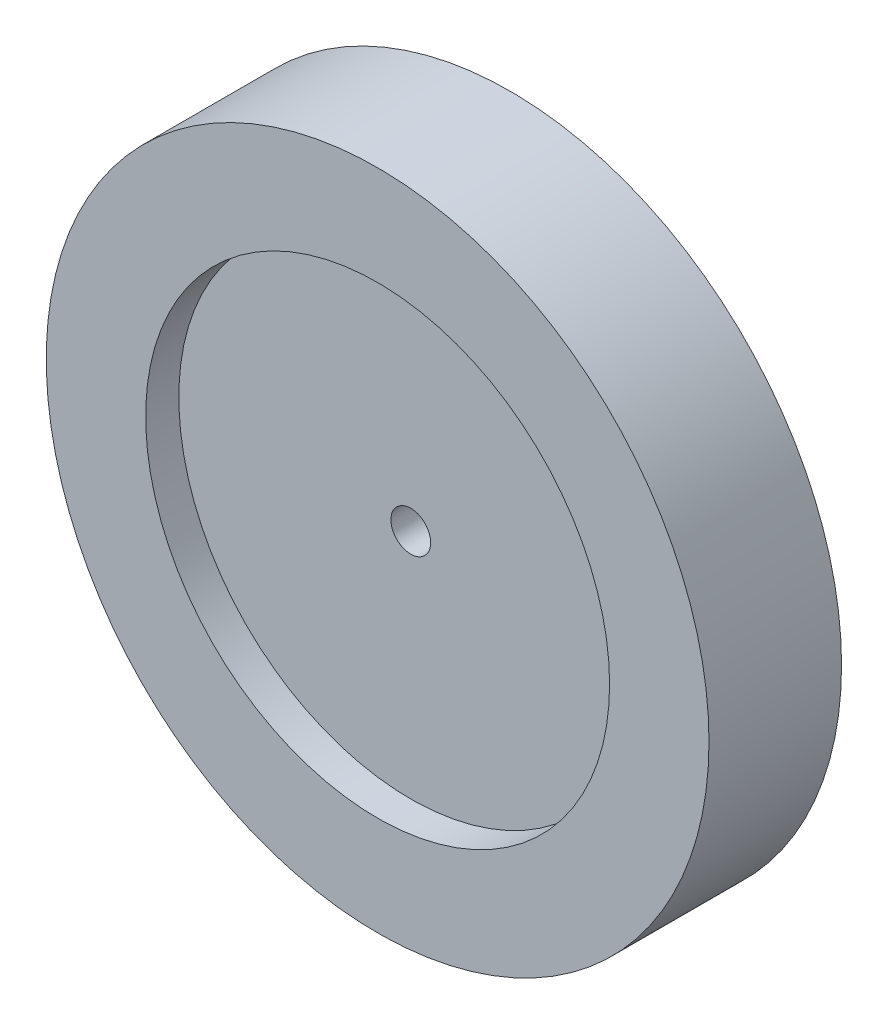
ISO-10303-21;
HEADER;
FILE_DESCRIPTION(('STEP AP214'),'2;1');
FILE_NAME('part.step','',(''),(''),'','','');
FILE_SCHEMA(('AUTOMOTIVE_DESIGN { 1 0 10303 214 1 1 1 1 }'));
ENDSEC;
DATA;
#1=APPLICATION_CONTEXT('core data for automotive mechanical design processes');
#2=APPLICATION_PROTOCOL_DEFINITION('international standard','automotive_design',2000,#1);
#3=PRODUCT_CONTEXT('',#1,'mechanical');
#4=PRODUCT('Part','Part','',(#3));
#5=PRODUCT_RELATED_PRODUCT_CATEGORY('part','',(#4));
#6=PRODUCT_DEFINITION_FORMATION('','',#4);
#7=PRODUCT_DEFINITION_CONTEXT('part definition',#1,'design');
#8=PRODUCT_DEFINITION('design','',#6,#7);
#9=PRODUCT_DEFINITION_SHAPE('','',#8);
#10=(LENGTH_UNIT() NAMED_UNIT(*) SI_UNIT(.MILLI.,.METRE.));
#11=(NAMED_UNIT(*) PLANE_ANGLE_UNIT() SI_UNIT($,.RADIAN.));
#12=(NAMED_UNIT(*) SI_UNIT($,.STERADIAN.) SOLID_ANGLE_UNIT());
#13=UNCERTAINTY_MEASURE_WITH_UNIT(LENGTH_MEASURE(1.E-05),#10,'distance_accuracy_value','');
#14=(GEOMETRIC_REPRESENTATION_CONTEXT(3) GLOBAL_UNCERTAINTY_ASSIGNED_CONTEXT((#13)) GLOBAL_UNIT_ASSIGNED_CONTEXT((#10,
#11,#12)) REPRESENTATION_CONTEXT('',''));
#15=CARTESIAN_POINT('',(0.,0.,0.));
#16=DIRECTION('',(0.,0.,1.));
#17=DIRECTION('',(1.,0.,0.));
#18=AXIS2_PLACEMENT_3D('',#15,#16,#17);
#19=CARTESIAN_POINT('',(0.,0.,10.));
#20=DIRECTION('',(0.,0.,-1.));
#21=DIRECTION('',(-1.,0.,0.));
#22=AXIS2_PLACEMENT_3D('',#19,#20,#21);
#23=CYLINDRICAL_SURFACE('',#22,50.);
#24=CARTESIAN_POINT('',(0.,0.,10.));
#25=DIRECTION('',(0.,0.,1.));
#26=DIRECTION('',(1.,0.,0.));
#27=AXIS2_PLACEMENT_3D('',#24,#25,#26);
#28=CIRCLE('',#27,50.);
#29=CARTESIAN_POINT('',(50.,0.,10.));
#30=VERTEX_POINT('',#29);
#31=EDGE_CURVE('E10',#30,#30,#28,.T.);
#32=ORIENTED_EDGE('',*,*,#31,.F.);
#33=EDGE_LOOP('',(#32));
#34=FACE_BOUND('',#33,.T.);
#35=CARTESIAN_POINT('',(0.,0.,-10.));
#36=DIRECTION('',(0.,0.,1.));
#37=DIRECTION('',(1.,0.,0.));
#38=AXIS2_PLACEMENT_3D('',#35,#36,#37);
#39=CIRCLE('',#38,50.);
#40=CARTESIAN_POINT('',(50.,0.,-10.));
#41=VERTEX_POINT('',#40);
#42=EDGE_CURVE('E36',#41,#41,#39,.T.);
#43=ORIENTED_EDGE('',*,*,#42,.T.);
#44=EDGE_LOOP('',(#43));
#45=FACE_BOUND('',#44,.T.);
#46=ADVANCED_FACE('F33',(#34,#45),#23,.T.);
#47=CARTESIAN_POINT('',(0.,0.,10.));
#48=DIRECTION('',(0.,0.,1.));
#49=DIRECTION('',(1.,0.,0.));
#50=AXIS2_PLACEMENT_3D('',#47,#48,#49);
#51=PLANE('',#50);
#52=CARTESIAN_POINT('',(0.,0.,10.));
#53=DIRECTION('',(0.,0.,1.));
#54=DIRECTION('',(1.,0.,0.));
#55=AXIS2_PLACEMENT_3D('',#52,#53,#54);
#56=CIRCLE('',#55,35.);
#57=CARTESIAN_POINT('',(35.,0.,10.));
#58=VERTEX_POINT('',#57);
#59=EDGE_CURVE('E45',#58,#58,#56,.T.);
#60=ORIENTED_EDGE('',*,*,#59,.F.);
#61=EDGE_LOOP('',(#60));
#62=FACE_BOUND('',#61,.T.);
#63=ORIENTED_EDGE('',*,*,#31,.T.);
#64=EDGE_LOOP('',(#63));
#65=FACE_BOUND('',#64,.T.);
#66=ADVANCED_FACE('F100',(#62,#65),#51,.T.);
#67=CARTESIAN_POINT('',(0.,0.,-10.));
#68=DIRECTION('',(0.,0.,1.));
#69=DIRECTION('',(1.,0.,0.));
#70=AXIS2_PLACEMENT_3D('',#67,#68,#69);
#71=PLANE('',#70);
#72=CARTESIAN_POINT('',(0.,0.,-10.));
#73=DIRECTION('',(0.,0.,1.));
#74=DIRECTION('',(1.,0.,0.));
#75=AXIS2_PLACEMENT_3D('',#72,#73,#74);
#76=CIRCLE('',#75,35.);
#77=CARTESIAN_POINT('',(35.,0.,-10.));
#78=VERTEX_POINT('',#77);
#79=EDGE_CURVE('E51',#78,#78,#76,.T.);
#80=ORIENTED_EDGE('',*,*,#79,.T.);
#81=EDGE_LOOP('',(#80));
#82=FACE_BOUND('',#81,.T.);
#83=ORIENTED_EDGE('',*,*,#42,.F.);
#84=EDGE_LOOP('',(#83));
#85=FACE_BOUND('',#84,.T.);
#86=ADVANCED_FACE('F96',(#82,#85),#71,.F.);
#87=CARTESIAN_POINT('',(0.,0.,5.));
#88=DIRECTION('',(0.,0.,1.));
#89=DIRECTION('',(1.,0.,0.));
#90=AXIS2_PLACEMENT_3D('',#87,#88,#89);
#91=CYLINDRICAL_SURFACE('',#90,35.);
#92=CARTESIAN_POINT('',(0.,0.,5.));
#93=DIRECTION('',(0.,0.,1.));
#94=DIRECTION('',(1.,0.,0.));
#95=AXIS2_PLACEMENT_3D('',#92,#93,#94);
#96=CIRCLE('',#95,35.);
#97=CARTESIAN_POINT('',(35.,0.,5.));
#98=VERTEX_POINT('',#97);
#99=EDGE_CURVE('E43',#98,#98,#96,.T.);
#100=ORIENTED_EDGE('',*,*,#99,.F.);
#101=EDGE_LOOP('',(#100));
#102=FACE_BOUND('',#101,.T.);
#103=ORIENTED_EDGE('',*,*,#59,.T.);
#104=EDGE_LOOP('',(#103));
#105=FACE_BOUND('',#104,.T.);
#106=ADVANCED_FACE('F99',(#102,#105),#91,.F.);
#107=CARTESIAN_POINT('',(0.,0.,5.));
#108=DIRECTION('',(0.,0.,1.));
#109=DIRECTION('',(1.,0.,0.));
#110=AXIS2_PLACEMENT_3D('',#107,#108,#109);
#111=PLANE('',#110);
#112=CARTESIAN_POINT('',(0.,0.,5.));
#113=DIRECTION('',(0.,0.,1.));
#114=DIRECTION('',(1.,0.,0.));
#115=AXIS2_PLACEMENT_3D('',#112,#113,#114);
#116=CIRCLE('',#115,3.);
#117=CARTESIAN_POINT('',(3.,0.,5.));
#118=VERTEX_POINT('',#117);
#119=EDGE_CURVE('E63',#118,#118,#116,.F.);
#120=ORIENTED_EDGE('',*,*,#119,.T.);
#121=EDGE_LOOP('',(#120));
#122=FACE_BOUND('',#121,.T.);
#123=ORIENTED_EDGE('',*,*,#99,.T.);
#124=EDGE_LOOP('',(#123));
#125=FACE_BOUND('',#124,.T.);
#126=ADVANCED_FACE('F92',(#122,#125),#111,.T.);
#127=CARTESIAN_POINT('',(0.,0.,-5.));
#128=DIRECTION('',(0.,0.,-1.));
#129=DIRECTION('',(-1.,0.,0.));
#130=AXIS2_PLACEMENT_3D('',#127,#128,#129);
#131=CYLINDRICAL_SURFACE('',#130,35.);
#132=CARTESIAN_POINT('',(0.,0.,-5.));
#133=DIRECTION('',(0.,0.,1.));
#134=DIRECTION('',(1.,0.,0.));
#135=AXIS2_PLACEMENT_3D('',#132,#133,#134);
#136=CIRCLE('',#135,35.);
#137=CARTESIAN_POINT('',(35.,0.,-5.));
#138=VERTEX_POINT('',#137);
#139=EDGE_CURVE('E48',#138,#138,#136,.T.);
#140=ORIENTED_EDGE('',*,*,#139,.T.);
#141=EDGE_LOOP('',(#140));
#142=FACE_BOUND('',#141,.T.);
#143=ORIENTED_EDGE('',*,*,#79,.F.);
#144=EDGE_LOOP('',(#143));
#145=FACE_BOUND('',#144,.T.);
#146=ADVANCED_FACE('F86',(#142,#145),#131,.F.);
#147=CARTESIAN_POINT('',(0.,0.,-5.));
#148=DIRECTION('',(0.,0.,-1.));
#149=DIRECTION('',(1.,0.,0.));
#150=AXIS2_PLACEMENT_3D('',#147,#148,#149);
#151=PLANE('',#150);
#152=CARTESIAN_POINT('',(0.,0.,-5.));
#153=DIRECTION('',(0.,0.,-1.));
#154=DIRECTION('',(-1.,0.,0.));
#155=AXIS2_PLACEMENT_3D('',#152,#153,#154);
#156=CIRCLE('',#155,7.5);
#157=CARTESIAN_POINT('',(-7.5,0.,-5.));
#158=VERTEX_POINT('',#157);
#159=EDGE_CURVE('E57',#158,#158,#156,.T.);
#160=ORIENTED_EDGE('',*,*,#159,.F.);
#161=EDGE_LOOP('',(#160));
#162=FACE_BOUND('',#161,.T.);
#163=ORIENTED_EDGE('',*,*,#139,.F.);
#164=EDGE_LOOP('',(#163));
#165=FACE_BOUND('',#164,.T.);
#166=ADVANCED_FACE('F80',(#162,#165),#151,.T.);
#167=CARTESIAN_POINT('',(0.,0.,-25.));
#168=DIRECTION('',(0.,0.,1.));
#169=DIRECTION('',(1.,0.,0.));
#170=AXIS2_PLACEMENT_3D('',#167,#168,#169);
#171=CYLINDRICAL_SURFACE('',#170,7.5);
#172=CARTESIAN_POINT('',(0.,0.,-25.));
#173=DIRECTION('',(0.,0.,-1.));
#174=DIRECTION('',(-1.,0.,0.));
#175=AXIS2_PLACEMENT_3D('',#172,#173,#174);
#176=CIRCLE('',#175,7.5);
#177=CARTESIAN_POINT('',(-7.5,0.,-25.));
#178=VERTEX_POINT('',#177);
#179=EDGE_CURVE('E54',#178,#178,#176,.T.);
#180=ORIENTED_EDGE('',*,*,#179,.F.);
#181=EDGE_LOOP('',(#180));
#182=FACE_BOUND('',#181,.T.);
#183=ORIENTED_EDGE('',*,*,#159,.T.);
#184=EDGE_LOOP('',(#183));
#185=FACE_BOUND('',#184,.T.);
#186=ADVANCED_FACE('F74',(#182,#185),#171,.T.);
#187=CARTESIAN_POINT('',(0.,0.,-25.));
#188=DIRECTION('',(0.,0.,-1.));
#189=DIRECTION('',(-1.,0.,0.));
#190=AXIS2_PLACEMENT_3D('',#187,#188,#189);
#191=PLANE('',#190);
#192=CARTESIAN_POINT('',(0.,0.,-25.));
#193=DIRECTION('',(0.,0.,-1.));
#194=DIRECTION('',(-1.,0.,0.));
#195=AXIS2_PLACEMENT_3D('',#192,#193,#194);
#196=CIRCLE('',#195,3.);
#197=CARTESIAN_POINT('',(-3.,0.,-25.));
#198=VERTEX_POINT('',#197);
#199=EDGE_CURVE('E60',#198,#198,#196,.T.);
#200=ORIENTED_EDGE('',*,*,#199,.F.);
#201=EDGE_LOOP('',(#200));
#202=FACE_BOUND('',#201,.T.);
#203=ORIENTED_EDGE('',*,*,#179,.T.);
#204=EDGE_LOOP('',(#203));
#205=FACE_BOUND('',#204,.T.);
#206=ADVANCED_FACE('F71',(#202,#205),#191,.T.);
#207=CARTESIAN_POINT('',(0.,0.,10.001));
#208=DIRECTION('',(0.,0.,-1.));
#209=DIRECTION('',(-1.,0.,0.));
#210=AXIS2_PLACEMENT_3D('',#207,#208,#209);
#211=CYLINDRICAL_SURFACE('',#210,3.);
#212=ORIENTED_EDGE('',*,*,#119,.F.);
#213=EDGE_LOOP('',(#212));
#214=FACE_BOUND('',#213,.T.);
#215=ORIENTED_EDGE('',*,*,#199,.T.);
#216=EDGE_LOOP('',(#215));
#217=FACE_BOUND('',#216,.T.);
#218=ADVANCED_FACE('F69',(#214,#217),#211,.F.);
#219=CLOSED_SHELL('',(#46,#66,#86,#106,#126,#146,#166,#186,#206,#218));
#220=MANIFOLD_SOLID_BREP('B2',#219);
#221=ADVANCED_BREP_SHAPE_REPRESENTATION('',(#18,#220),#14);
#222=SHAPE_DEFINITION_REPRESENTATION(#9,#221);
ENDSEC;
END-ISO-10303-21;
